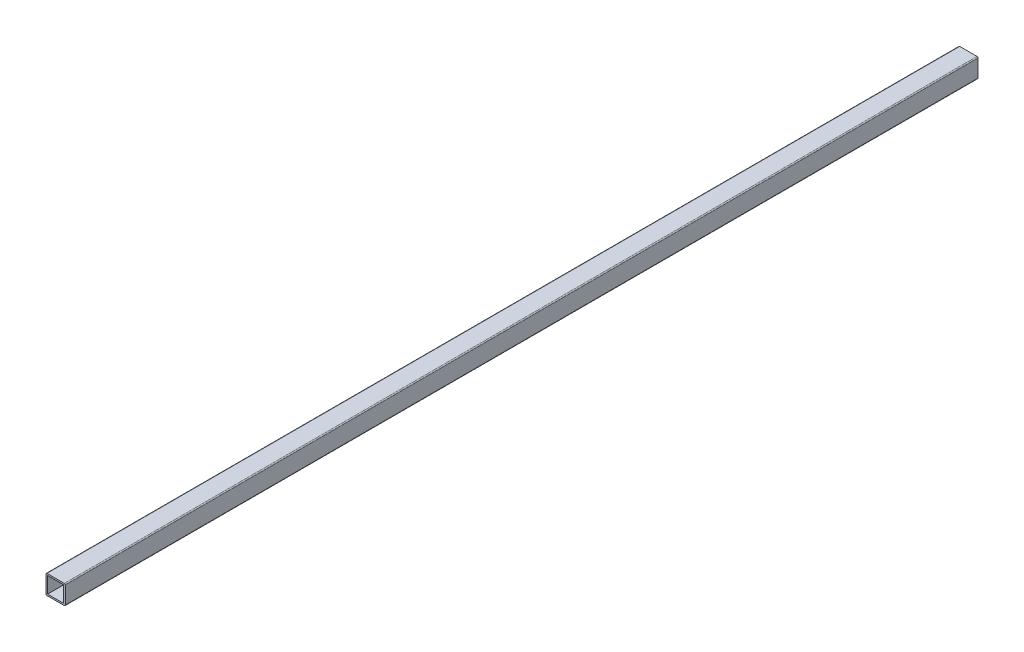
ISO-10303-21;
HEADER;
FILE_DESCRIPTION(('STEP AP214'),'2;1');
FILE_NAME('part.step','',(''),(''),'','','');
FILE_SCHEMA(('AUTOMOTIVE_DESIGN { 1 0 10303 214 1 1 1 1 }'));
ENDSEC;
DATA;
#1=APPLICATION_CONTEXT('core data for automotive mechanical design processes');
#2=APPLICATION_PROTOCOL_DEFINITION('international standard','automotive_design',2000,#1);
#3=PRODUCT_CONTEXT('',#1,'mechanical');
#4=PRODUCT('Part','Part','',(#3));
#5=PRODUCT_RELATED_PRODUCT_CATEGORY('part','',(#4));
#6=PRODUCT_DEFINITION_FORMATION('','',#4);
#7=PRODUCT_DEFINITION_CONTEXT('part definition',#1,'design');
#8=PRODUCT_DEFINITION('design','',#6,#7);
#9=PRODUCT_DEFINITION_SHAPE('','',#8);
#10=(LENGTH_UNIT() NAMED_UNIT(*) SI_UNIT(.MILLI.,.METRE.));
#11=(NAMED_UNIT(*) PLANE_ANGLE_UNIT() SI_UNIT($,.RADIAN.));
#12=(NAMED_UNIT(*) SI_UNIT($,.STERADIAN.) SOLID_ANGLE_UNIT());
#13=UNCERTAINTY_MEASURE_WITH_UNIT(LENGTH_MEASURE(1.E-05),#10,'distance_accuracy_value','');
#14=(GEOMETRIC_REPRESENTATION_CONTEXT(3) GLOBAL_UNCERTAINTY_ASSIGNED_CONTEXT((#13)) GLOBAL_UNIT_ASSIGNED_CONTEXT((#10,
#11,#12)) REPRESENTATION_CONTEXT('',''));
#15=CARTESIAN_POINT('',(0.,0.,0.));
#16=DIRECTION('',(0.,0.,1.));
#17=DIRECTION('',(1.,0.,0.));
#18=AXIS2_PLACEMENT_3D('',#15,#16,#17);
#19=CARTESIAN_POINT('',(0.,0.,900.));
#20=DIRECTION('',(0.,0.,1.));
#21=DIRECTION('',(1.,0.,0.));
#22=AXIS2_PLACEMENT_3D('',#19,#20,#21);
#23=PLANE('',#22);
#24=DIRECTION('',(0.,-1.,0.));
#25=VECTOR('',#24,1.);
#26=CARTESIAN_POINT('',(0.,0.,900.));
#27=LINE('',#26,#25);
#28=CARTESIAN_POINT('',(0.,-1.,900.));
#29=VERTEX_POINT('',#28);
#30=CARTESIAN_POINT('',(0.,-18.,900.));
#31=VERTEX_POINT('',#30);
#32=EDGE_CURVE('E165',#29,#31,#27,.T.);
#33=ORIENTED_EDGE('',*,*,#32,.T.);
#34=CARTESIAN_POINT('',(1.,-18.,900.));
#35=DIRECTION('',(0.,0.,1.));
#36=DIRECTION('',(1.,0.,0.));
#37=AXIS2_PLACEMENT_3D('',#34,#35,#36);
#38=CIRCLE('',#37,1.);
#39=CARTESIAN_POINT('',(1.,-19.,900.));
#40=VERTEX_POINT('',#39);
#41=EDGE_CURVE('E208',#31,#40,#38,.T.);
#42=ORIENTED_EDGE('',*,*,#41,.T.);
#43=DIRECTION('',(1.,0.,0.));
#44=VECTOR('',#43,1.);
#45=CARTESIAN_POINT('',(0.,-19.,900.));
#46=LINE('',#45,#44);
#47=CARTESIAN_POINT('',(18.,-19.,900.));
#48=VERTEX_POINT('',#47);
#49=EDGE_CURVE('E168',#40,#48,#46,.T.);
#50=ORIENTED_EDGE('',*,*,#49,.T.);
#51=CARTESIAN_POINT('',(18.,-18.,900.));
#52=DIRECTION('',(0.,0.,1.));
#53=DIRECTION('',(1.,0.,0.));
#54=AXIS2_PLACEMENT_3D('',#51,#52,#53);
#55=CIRCLE('',#54,1.);
#56=CARTESIAN_POINT('',(19.,-18.,900.));
#57=VERTEX_POINT('',#56);
#58=EDGE_CURVE('E204',#48,#57,#55,.T.);
#59=ORIENTED_EDGE('',*,*,#58,.T.);
#60=DIRECTION('',(0.,1.,0.));
#61=VECTOR('',#60,1.);
#62=CARTESIAN_POINT('',(19.,0.,900.));
#63=LINE('',#62,#61);
#64=CARTESIAN_POINT('',(19.,-1.,900.));
#65=VERTEX_POINT('',#64);
#66=EDGE_CURVE('E172',#57,#65,#63,.T.);
#67=ORIENTED_EDGE('',*,*,#66,.T.);
#68=CARTESIAN_POINT('',(18.,-1.,900.));
#69=DIRECTION('',(0.,0.,1.));
#70=DIRECTION('',(1.,0.,0.));
#71=AXIS2_PLACEMENT_3D('',#68,#69,#70);
#72=CIRCLE('',#71,1.);
#73=CARTESIAN_POINT('',(18.,0.,900.));
#74=VERTEX_POINT('',#73);
#75=EDGE_CURVE('E54',#65,#74,#72,.T.);
#76=ORIENTED_EDGE('',*,*,#75,.T.);
#77=DIRECTION('',(-1.,0.,0.));
#78=VECTOR('',#77,1.);
#79=CARTESIAN_POINT('',(0.,0.,900.));
#80=LINE('',#79,#78);
#81=CARTESIAN_POINT('',(1.,0.,900.));
#82=VERTEX_POINT('',#81);
#83=EDGE_CURVE('E174',#74,#82,#80,.T.);
#84=ORIENTED_EDGE('',*,*,#83,.T.);
#85=CARTESIAN_POINT('',(1.,-1.,900.));
#86=DIRECTION('',(0.,0.,1.));
#87=DIRECTION('',(1.,0.,0.));
#88=AXIS2_PLACEMENT_3D('',#85,#86,#87);
#89=CIRCLE('',#88,1.);
#90=EDGE_CURVE('E206',#82,#29,#89,.T.);
#91=ORIENTED_EDGE('',*,*,#90,.T.);
#92=EDGE_LOOP('',(#33,#42,#50,#59,#67,#76,#84,#91));
#93=FACE_BOUND('',#92,.T.);
#94=DIRECTION('',(1.,0.,0.));
#95=VECTOR('',#94,1.);
#96=CARTESIAN_POINT('',(1.56,-17.44,900.));
#97=LINE('',#96,#95);
#98=CARTESIAN_POINT('',(1.56,-17.44,900.));
#99=VERTEX_POINT('',#98);
#100=CARTESIAN_POINT('',(17.44,-17.44,900.));
#101=VERTEX_POINT('',#100);
#102=EDGE_CURVE('E134',#99,#101,#97,.T.);
#103=ORIENTED_EDGE('',*,*,#102,.F.);
#104=DIRECTION('',(0.,-1.,0.));
#105=VECTOR('',#104,1.);
#106=CARTESIAN_POINT('',(1.56,-1.56,900.));
#107=LINE('',#106,#105);
#108=CARTESIAN_POINT('',(1.56,-1.56,900.));
#109=VERTEX_POINT('',#108);
#110=EDGE_CURVE('E124',#109,#99,#107,.T.);
#111=ORIENTED_EDGE('',*,*,#110,.F.);
#112=DIRECTION('',(-1.,0.,0.));
#113=VECTOR('',#112,1.);
#114=CARTESIAN_POINT('',(1.56,-1.56,900.));
#115=LINE('',#114,#113);
#116=CARTESIAN_POINT('',(17.44,-1.56,900.));
#117=VERTEX_POINT('',#116);
#118=EDGE_CURVE('E149',#117,#109,#115,.T.);
#119=ORIENTED_EDGE('',*,*,#118,.F.);
#120=DIRECTION('',(0.,1.,0.));
#121=VECTOR('',#120,1.);
#122=CARTESIAN_POINT('',(17.44,-1.56,900.));
#123=LINE('',#122,#121);
#124=EDGE_CURVE('E147',#101,#117,#123,.T.);
#125=ORIENTED_EDGE('',*,*,#124,.F.);
#126=EDGE_LOOP('',(#103,#111,#119,#125));
#127=FACE_BOUND('',#126,.T.);
#128=ADVANCED_FACE('F32',(#93,#127),#23,.T.);
#129=CARTESIAN_POINT('',(0.,0.,0.));
#130=DIRECTION('',(0.,0.,1.));
#131=DIRECTION('',(1.,0.,0.));
#132=AXIS2_PLACEMENT_3D('',#129,#130,#131);
#133=PLANE('',#132);
#134=DIRECTION('',(1.,0.,0.));
#135=VECTOR('',#134,1.);
#136=CARTESIAN_POINT('',(0.,-19.,0.));
#137=LINE('',#136,#135);
#138=CARTESIAN_POINT('',(1.,-19.,0.));
#139=VERTEX_POINT('',#138);
#140=CARTESIAN_POINT('',(18.,-19.,0.));
#141=VERTEX_POINT('',#140);
#142=EDGE_CURVE('E179',#139,#141,#137,.T.);
#143=ORIENTED_EDGE('',*,*,#142,.F.);
#144=CARTESIAN_POINT('',(1.,-18.,0.));
#145=DIRECTION('',(0.,0.,1.));
#146=DIRECTION('',(1.,0.,0.));
#147=AXIS2_PLACEMENT_3D('',#144,#145,#146);
#148=CIRCLE('',#147,1.);
#149=CARTESIAN_POINT('',(0.,-18.,0.));
#150=VERTEX_POINT('',#149);
#151=EDGE_CURVE('E196',#139,#150,#148,.F.);
#152=ORIENTED_EDGE('',*,*,#151,.T.);
#153=DIRECTION('',(0.,-1.,0.));
#154=VECTOR('',#153,1.);
#155=CARTESIAN_POINT('',(0.,0.,0.));
#156=LINE('',#155,#154);
#157=CARTESIAN_POINT('',(0.,-1.,0.));
#158=VERTEX_POINT('',#157);
#159=EDGE_CURVE('E142',#158,#150,#156,.T.);
#160=ORIENTED_EDGE('',*,*,#159,.F.);
#161=CARTESIAN_POINT('',(1.,-1.,0.));
#162=DIRECTION('',(0.,0.,1.));
#163=DIRECTION('',(1.,0.,0.));
#164=AXIS2_PLACEMENT_3D('',#161,#162,#163);
#165=CIRCLE('',#164,1.);
#166=CARTESIAN_POINT('',(1.,0.,0.));
#167=VERTEX_POINT('',#166);
#168=EDGE_CURVE('E194',#158,#167,#165,.F.);
#169=ORIENTED_EDGE('',*,*,#168,.T.);
#170=DIRECTION('',(-1.,0.,0.));
#171=VECTOR('',#170,1.);
#172=CARTESIAN_POINT('',(0.,0.,0.));
#173=LINE('',#172,#171);
#174=CARTESIAN_POINT('',(18.,0.,0.));
#175=VERTEX_POINT('',#174);
#176=EDGE_CURVE('E169',#175,#167,#173,.T.);
#177=ORIENTED_EDGE('',*,*,#176,.F.);
#178=CARTESIAN_POINT('',(18.,-1.,0.));
#179=DIRECTION('',(0.,0.,1.));
#180=DIRECTION('',(1.,0.,0.));
#181=AXIS2_PLACEMENT_3D('',#178,#179,#180);
#182=CIRCLE('',#181,1.);
#183=CARTESIAN_POINT('',(19.,-1.,0.));
#184=VERTEX_POINT('',#183);
#185=EDGE_CURVE('E190',#175,#184,#182,.F.);
#186=ORIENTED_EDGE('',*,*,#185,.T.);
#187=DIRECTION('',(0.,1.,0.));
#188=VECTOR('',#187,1.);
#189=CARTESIAN_POINT('',(19.,0.,0.));
#190=LINE('',#189,#188);
#191=CARTESIAN_POINT('',(19.,-18.,0.));
#192=VERTEX_POINT('',#191);
#193=EDGE_CURVE('E182',#192,#184,#190,.T.);
#194=ORIENTED_EDGE('',*,*,#193,.F.);
#195=CARTESIAN_POINT('',(18.,-18.,0.));
#196=DIRECTION('',(0.,0.,1.));
#197=DIRECTION('',(1.,0.,0.));
#198=AXIS2_PLACEMENT_3D('',#195,#196,#197);
#199=CIRCLE('',#198,1.);
#200=EDGE_CURVE('E192',#192,#141,#199,.F.);
#201=ORIENTED_EDGE('',*,*,#200,.T.);
#202=EDGE_LOOP('',(#143,#152,#160,#169,#177,#186,#194,#201));
#203=FACE_BOUND('',#202,.T.);
#204=DIRECTION('',(0.,-1.,0.));
#205=VECTOR('',#204,1.);
#206=CARTESIAN_POINT('',(1.56,-1.56,0.));
#207=LINE('',#206,#205);
#208=CARTESIAN_POINT('',(1.56,-1.56,0.));
#209=VERTEX_POINT('',#208);
#210=CARTESIAN_POINT('',(1.56,-17.44,0.));
#211=VERTEX_POINT('',#210);
#212=EDGE_CURVE('E153',#209,#211,#207,.T.);
#213=ORIENTED_EDGE('',*,*,#212,.T.);
#214=DIRECTION('',(1.,0.,0.));
#215=VECTOR('',#214,1.);
#216=CARTESIAN_POINT('',(1.56,-17.44,0.));
#217=LINE('',#216,#215);
#218=CARTESIAN_POINT('',(17.44,-17.44,0.));
#219=VERTEX_POINT('',#218);
#220=EDGE_CURVE('E141',#211,#219,#217,.T.);
#221=ORIENTED_EDGE('',*,*,#220,.T.);
#222=DIRECTION('',(0.,1.,0.));
#223=VECTOR('',#222,1.);
#224=CARTESIAN_POINT('',(17.44,-1.56,0.));
#225=LINE('',#224,#223);
#226=CARTESIAN_POINT('',(17.44,-1.56,0.));
#227=VERTEX_POINT('',#226);
#228=EDGE_CURVE('E156',#219,#227,#225,.T.);
#229=ORIENTED_EDGE('',*,*,#228,.T.);
#230=DIRECTION('',(-1.,0.,0.));
#231=VECTOR('',#230,1.);
#232=CARTESIAN_POINT('',(1.56,-1.56,0.));
#233=LINE('',#232,#231);
#234=EDGE_CURVE('E135',#227,#209,#233,.T.);
#235=ORIENTED_EDGE('',*,*,#234,.T.);
#236=EDGE_LOOP('',(#213,#221,#229,#235));
#237=FACE_BOUND('',#236,.T.);
#238=ADVANCED_FACE('F226',(#203,#237),#133,.F.);
#239=CARTESIAN_POINT('',(0.,0.,900.));
#240=DIRECTION('',(1.,0.,0.));
#241=DIRECTION('',(0.,1.,0.));
#242=AXIS2_PLACEMENT_3D('',#239,#240,#241);
#243=PLANE('',#242);
#244=ORIENTED_EDGE('',*,*,#159,.T.);
#245=DIRECTION('',(0.,0.,-1.));
#246=VECTOR('',#245,1.);
#247=CARTESIAN_POINT('',(0.,-18.,900.));
#248=LINE('',#247,#246);
#249=EDGE_CURVE('E201',#150,#31,#248,.F.);
#250=ORIENTED_EDGE('',*,*,#249,.T.);
#251=ORIENTED_EDGE('',*,*,#32,.F.);
#252=DIRECTION('',(0.,0.,-1.));
#253=VECTOR('',#252,1.);
#254=CARTESIAN_POINT('',(0.,-1.,900.));
#255=LINE('',#254,#253);
#256=EDGE_CURVE('E198',#29,#158,#255,.T.);
#257=ORIENTED_EDGE('',*,*,#256,.T.);
#258=EDGE_LOOP('',(#244,#250,#251,#257));
#259=FACE_BOUND('',#258,.T.);
#260=ADVANCED_FACE('F235',(#259),#243,.F.);
#261=CARTESIAN_POINT('',(0.,-19.,900.));
#262=DIRECTION('',(0.,1.,0.));
#263=DIRECTION('',(0.,0.,1.));
#264=AXIS2_PLACEMENT_3D('',#261,#262,#263);
#265=PLANE('',#264);
#266=ORIENTED_EDGE('',*,*,#49,.F.);
#267=DIRECTION('',(0.,0.,-1.));
#268=VECTOR('',#267,1.);
#269=CARTESIAN_POINT('',(1.,-19.,900.));
#270=LINE('',#269,#268);
#271=EDGE_CURVE('E187',#40,#139,#270,.T.);
#272=ORIENTED_EDGE('',*,*,#271,.T.);
#273=ORIENTED_EDGE('',*,*,#142,.T.);
#274=DIRECTION('',(0.,0.,-1.));
#275=VECTOR('',#274,1.);
#276=CARTESIAN_POINT('',(18.,-19.,900.));
#277=LINE('',#276,#275);
#278=EDGE_CURVE('E176',#141,#48,#277,.F.);
#279=ORIENTED_EDGE('',*,*,#278,.T.);
#280=EDGE_LOOP('',(#266,#272,#273,#279));
#281=FACE_BOUND('',#280,.T.);
#282=ADVANCED_FACE('F243',(#281),#265,.F.);
#283=CARTESIAN_POINT('',(19.,0.,900.));
#284=DIRECTION('',(-1.,0.,0.));
#285=DIRECTION('',(0.,0.,1.));
#286=AXIS2_PLACEMENT_3D('',#283,#284,#285);
#287=PLANE('',#286);
#288=ORIENTED_EDGE('',*,*,#66,.F.);
#289=DIRECTION('',(0.,0.,-1.));
#290=VECTOR('',#289,1.);
#291=CARTESIAN_POINT('',(19.,-18.,900.));
#292=LINE('',#291,#290);
#293=EDGE_CURVE('E11',#57,#192,#292,.T.);
#294=ORIENTED_EDGE('',*,*,#293,.T.);
#295=ORIENTED_EDGE('',*,*,#193,.T.);
#296=DIRECTION('',(0.,0.,-1.));
#297=VECTOR('',#296,1.);
#298=CARTESIAN_POINT('',(19.,-1.,900.));
#299=LINE('',#298,#297);
#300=EDGE_CURVE('E40',#184,#65,#299,.F.);
#301=ORIENTED_EDGE('',*,*,#300,.T.);
#302=EDGE_LOOP('',(#288,#294,#295,#301));
#303=FACE_BOUND('',#302,.T.);
#304=ADVANCED_FACE('F216',(#303),#287,.F.);
#305=CARTESIAN_POINT('',(0.,0.,900.));
#306=DIRECTION('',(0.,-1.,0.));
#307=DIRECTION('',(0.,0.,-1.));
#308=AXIS2_PLACEMENT_3D('',#305,#306,#307);
#309=PLANE('',#308);
#310=ORIENTED_EDGE('',*,*,#176,.T.);
#311=DIRECTION('',(0.,0.,-1.));
#312=VECTOR('',#311,1.);
#313=CARTESIAN_POINT('',(1.,0.,900.));
#314=LINE('',#313,#312);
#315=EDGE_CURVE('E47',#167,#82,#314,.F.);
#316=ORIENTED_EDGE('',*,*,#315,.T.);
#317=ORIENTED_EDGE('',*,*,#83,.F.);
#318=DIRECTION('',(0.,0.,-1.));
#319=VECTOR('',#318,1.);
#320=CARTESIAN_POINT('',(18.,0.,900.));
#321=LINE('',#320,#319);
#322=EDGE_CURVE('E210',#74,#175,#321,.T.);
#323=ORIENTED_EDGE('',*,*,#322,.T.);
#324=EDGE_LOOP('',(#310,#316,#317,#323));
#325=FACE_BOUND('',#324,.T.);
#326=ADVANCED_FACE('F223',(#325),#309,.F.);
#327=CARTESIAN_POINT('',(1.56,-1.56,900.));
#328=DIRECTION('',(1.,0.,0.));
#329=DIRECTION('',(0.,1.,0.));
#330=AXIS2_PLACEMENT_3D('',#327,#328,#329);
#331=PLANE('',#330);
#332=ORIENTED_EDGE('',*,*,#212,.F.);
#333=DIRECTION('',(0.,0.,-1.));
#334=VECTOR('',#333,1.);
#335=CARTESIAN_POINT('',(1.56,-1.56,900.));
#336=LINE('',#335,#334);
#337=EDGE_CURVE('E130',#109,#209,#336,.T.);
#338=ORIENTED_EDGE('',*,*,#337,.F.);
#339=ORIENTED_EDGE('',*,*,#110,.T.);
#340=DIRECTION('',(0.,0.,-1.));
#341=VECTOR('',#340,1.);
#342=CARTESIAN_POINT('',(1.56,-17.44,900.));
#343=LINE('',#342,#341);
#344=EDGE_CURVE('E127',#99,#211,#343,.T.);
#345=ORIENTED_EDGE('',*,*,#344,.T.);
#346=EDGE_LOOP('',(#332,#338,#339,#345));
#347=FACE_BOUND('',#346,.T.);
#348=ADVANCED_FACE('F126',(#347),#331,.T.);
#349=CARTESIAN_POINT('',(1.56,-17.44,900.));
#350=DIRECTION('',(0.,1.,0.));
#351=DIRECTION('',(0.,0.,1.));
#352=AXIS2_PLACEMENT_3D('',#349,#350,#351);
#353=PLANE('',#352);
#354=ORIENTED_EDGE('',*,*,#220,.F.);
#355=ORIENTED_EDGE('',*,*,#344,.F.);
#356=ORIENTED_EDGE('',*,*,#102,.T.);
#357=DIRECTION('',(0.,0.,-1.));
#358=VECTOR('',#357,1.);
#359=CARTESIAN_POINT('',(17.44,-17.44,900.));
#360=LINE('',#359,#358);
#361=EDGE_CURVE('E143',#101,#219,#360,.T.);
#362=ORIENTED_EDGE('',*,*,#361,.T.);
#363=EDGE_LOOP('',(#354,#355,#356,#362));
#364=FACE_BOUND('',#363,.T.);
#365=ADVANCED_FACE('F138',(#364),#353,.T.);
#366=CARTESIAN_POINT('',(17.44,-1.56,900.));
#367=DIRECTION('',(-1.,0.,0.));
#368=DIRECTION('',(0.,-1.,0.));
#369=AXIS2_PLACEMENT_3D('',#366,#367,#368);
#370=PLANE('',#369);
#371=ORIENTED_EDGE('',*,*,#228,.F.);
#372=ORIENTED_EDGE('',*,*,#361,.F.);
#373=ORIENTED_EDGE('',*,*,#124,.T.);
#374=DIRECTION('',(0.,0.,-1.));
#375=VECTOR('',#374,1.);
#376=CARTESIAN_POINT('',(17.44,-1.56,900.));
#377=LINE('',#376,#375);
#378=EDGE_CURVE('E162',#117,#227,#377,.T.);
#379=ORIENTED_EDGE('',*,*,#378,.T.);
#380=EDGE_LOOP('',(#371,#372,#373,#379));
#381=FACE_BOUND('',#380,.T.);
#382=ADVANCED_FACE('F275',(#381),#370,.T.);
#383=CARTESIAN_POINT('',(1.56,-1.56,900.));
#384=DIRECTION('',(0.,-1.,0.));
#385=DIRECTION('',(0.,0.,-1.));
#386=AXIS2_PLACEMENT_3D('',#383,#384,#385);
#387=PLANE('',#386);
#388=ORIENTED_EDGE('',*,*,#234,.F.);
#389=ORIENTED_EDGE('',*,*,#378,.F.);
#390=ORIENTED_EDGE('',*,*,#118,.T.);
#391=ORIENTED_EDGE('',*,*,#337,.T.);
#392=EDGE_LOOP('',(#388,#389,#390,#391));
#393=FACE_BOUND('',#392,.T.);
#394=ADVANCED_FACE('F271',(#393),#387,.T.);
#395=CARTESIAN_POINT('',(1.,-18.,900.));
#396=DIRECTION('',(0.,0.,-1.));
#397=DIRECTION('',(-1.,0.,0.));
#398=AXIS2_PLACEMENT_3D('',#395,#396,#397);
#399=CYLINDRICAL_SURFACE('',#398,1.);
#400=ORIENTED_EDGE('',*,*,#41,.F.);
#401=ORIENTED_EDGE('',*,*,#249,.F.);
#402=ORIENTED_EDGE('',*,*,#151,.F.);
#403=ORIENTED_EDGE('',*,*,#271,.F.);
#404=EDGE_LOOP('',(#400,#401,#402,#403));
#405=FACE_BOUND('',#404,.T.);
#406=ADVANCED_FACE('F241',(#405),#399,.T.);
#407=CARTESIAN_POINT('',(1.,-1.,900.));
#408=DIRECTION('',(0.,0.,-1.));
#409=DIRECTION('',(-1.,0.,0.));
#410=AXIS2_PLACEMENT_3D('',#407,#408,#409);
#411=CYLINDRICAL_SURFACE('',#410,1.);
#412=ORIENTED_EDGE('',*,*,#90,.F.);
#413=ORIENTED_EDGE('',*,*,#315,.F.);
#414=ORIENTED_EDGE('',*,*,#168,.F.);
#415=ORIENTED_EDGE('',*,*,#256,.F.);
#416=EDGE_LOOP('',(#412,#413,#414,#415));
#417=FACE_BOUND('',#416,.T.);
#418=ADVANCED_FACE('F232',(#417),#411,.T.);
#419=CARTESIAN_POINT('',(18.,-18.,900.));
#420=DIRECTION('',(0.,0.,-1.));
#421=DIRECTION('',(-1.,0.,0.));
#422=AXIS2_PLACEMENT_3D('',#419,#420,#421);
#423=CYLINDRICAL_SURFACE('',#422,1.);
#424=ORIENTED_EDGE('',*,*,#58,.F.);
#425=ORIENTED_EDGE('',*,*,#278,.F.);
#426=ORIENTED_EDGE('',*,*,#200,.F.);
#427=ORIENTED_EDGE('',*,*,#293,.F.);
#428=EDGE_LOOP('',(#424,#425,#426,#427));
#429=FACE_BOUND('',#428,.T.);
#430=ADVANCED_FACE('F246',(#429),#423,.T.);
#431=CARTESIAN_POINT('',(18.,-1.,900.));
#432=DIRECTION('',(0.,0.,-1.));
#433=DIRECTION('',(-1.,0.,0.));
#434=AXIS2_PLACEMENT_3D('',#431,#432,#433);
#435=CYLINDRICAL_SURFACE('',#434,1.);
#436=ORIENTED_EDGE('',*,*,#75,.F.);
#437=ORIENTED_EDGE('',*,*,#300,.F.);
#438=ORIENTED_EDGE('',*,*,#185,.F.);
#439=ORIENTED_EDGE('',*,*,#322,.F.);
#440=EDGE_LOOP('',(#436,#437,#438,#439));
#441=FACE_BOUND('',#440,.T.);
#442=ADVANCED_FACE('F34',(#441),#435,.T.);
#443=CLOSED_SHELL('',(#128,#238,#260,#282,#304,#326,#348,#365,#382,#394,#406,#418,#430,#442));
#444=MANIFOLD_SOLID_BREP('B2',#443);
#445=ADVANCED_BREP_SHAPE_REPRESENTATION('',(#18,#444),#14);
#446=SHAPE_DEFINITION_REPRESENTATION(#9,#445);
ENDSEC;
END-ISO-10303-21;
